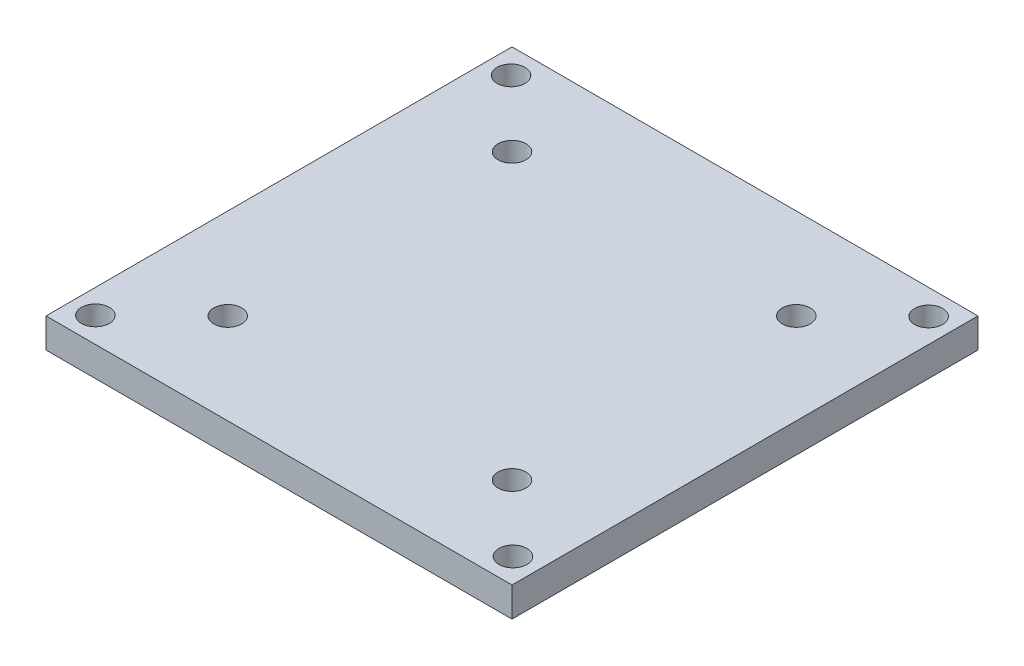
ISO-10303-21;
HEADER;
FILE_DESCRIPTION(('STEP AP214'),'2;1');
FILE_NAME('part.step','',(''),(''),'','','');
FILE_SCHEMA(('AUTOMOTIVE_DESIGN { 1 0 10303 214 1 1 1 1 }'));
ENDSEC;
DATA;
#1=APPLICATION_CONTEXT('core data for automotive mechanical design processes');
#2=APPLICATION_PROTOCOL_DEFINITION('international standard','automotive_design',2000,#1);
#3=PRODUCT_CONTEXT('',#1,'mechanical');
#4=PRODUCT('Part','Part','',(#3));
#5=PRODUCT_RELATED_PRODUCT_CATEGORY('part','',(#4));
#6=PRODUCT_DEFINITION_FORMATION('','',#4);
#7=PRODUCT_DEFINITION_CONTEXT('part definition',#1,'design');
#8=PRODUCT_DEFINITION('design','',#6,#7);
#9=PRODUCT_DEFINITION_SHAPE('','',#8);
#10=(LENGTH_UNIT() NAMED_UNIT(*) SI_UNIT(.MILLI.,.METRE.));
#11=(NAMED_UNIT(*) PLANE_ANGLE_UNIT() SI_UNIT($,.RADIAN.));
#12=(NAMED_UNIT(*) SI_UNIT($,.STERADIAN.) SOLID_ANGLE_UNIT());
#13=UNCERTAINTY_MEASURE_WITH_UNIT(LENGTH_MEASURE(1.E-05),#10,'distance_accuracy_value','');
#14=(GEOMETRIC_REPRESENTATION_CONTEXT(3) GLOBAL_UNCERTAINTY_ASSIGNED_CONTEXT((#13)) GLOBAL_UNIT_ASSIGNED_CONTEXT((#10,
#11,#12)) REPRESENTATION_CONTEXT('',''));
#15=CARTESIAN_POINT('',(0.,0.,0.));
#16=DIRECTION('',(0.,0.,1.));
#17=DIRECTION('',(1.,0.,0.));
#18=AXIS2_PLACEMENT_3D('',#15,#16,#17);
#19=CARTESIAN_POINT('',(0.,3.175,-25.));
#20=DIRECTION('',(0.,0.,1.));
#21=DIRECTION('',(1.,0.,0.));
#22=AXIS2_PLACEMENT_3D('',#19,#20,#21);
#23=PLANE('',#22);
#24=DIRECTION('',(-1.,0.,0.));
#25=VECTOR('',#24,1.);
#26=CARTESIAN_POINT('',(0.,0.,-25.));
#27=LINE('',#26,#25);
#28=CARTESIAN_POINT('',(25.,0.,-25.));
#29=VERTEX_POINT('',#28);
#30=CARTESIAN_POINT('',(-25.,0.,-25.));
#31=VERTEX_POINT('',#30);
#32=EDGE_CURVE('E146',#29,#31,#27,.T.);
#33=ORIENTED_EDGE('',*,*,#32,.T.);
#34=DIRECTION('',(0.,-1.,0.));
#35=VECTOR('',#34,1.);
#36=CARTESIAN_POINT('',(-25.,3.175,-25.));
#37=LINE('',#36,#35);
#38=CARTESIAN_POINT('',(-25.,3.175,-25.));
#39=VERTEX_POINT('',#38);
#40=EDGE_CURVE('E11',#39,#31,#37,.T.);
#41=ORIENTED_EDGE('',*,*,#40,.F.);
#42=DIRECTION('',(-1.,0.,0.));
#43=VECTOR('',#42,1.);
#44=CARTESIAN_POINT('',(0.,3.175,-25.));
#45=LINE('',#44,#43);
#46=CARTESIAN_POINT('',(25.,3.175,-25.));
#47=VERTEX_POINT('',#46);
#48=EDGE_CURVE('E96',#47,#39,#45,.T.);
#49=ORIENTED_EDGE('',*,*,#48,.F.);
#50=DIRECTION('',(0.,-1.,0.));
#51=VECTOR('',#50,1.);
#52=CARTESIAN_POINT('',(25.,3.175,-25.));
#53=LINE('',#52,#51);
#54=EDGE_CURVE('E63',#47,#29,#53,.T.);
#55=ORIENTED_EDGE('',*,*,#54,.T.);
#56=EDGE_LOOP('',(#33,#41,#49,#55));
#57=FACE_BOUND('',#56,.T.);
#58=ADVANCED_FACE('F45',(#57),#23,.F.);
#59=CARTESIAN_POINT('',(-25.,3.175,0.));
#60=DIRECTION('',(1.,0.,0.));
#61=DIRECTION('',(0.,0.,-1.));
#62=AXIS2_PLACEMENT_3D('',#59,#60,#61);
#63=PLANE('',#62);
#64=DIRECTION('',(0.,0.,1.));
#65=VECTOR('',#64,1.);
#66=CARTESIAN_POINT('',(-25.,0.,0.));
#67=LINE('',#66,#65);
#68=CARTESIAN_POINT('',(-25.,0.,25.));
#69=VERTEX_POINT('',#68);
#70=EDGE_CURVE('E102',#31,#69,#67,.T.);
#71=ORIENTED_EDGE('',*,*,#70,.T.);
#72=DIRECTION('',(0.,-1.,0.));
#73=VECTOR('',#72,1.);
#74=CARTESIAN_POINT('',(-25.,3.175,25.));
#75=LINE('',#74,#73);
#76=CARTESIAN_POINT('',(-25.,3.175,25.));
#77=VERTEX_POINT('',#76);
#78=EDGE_CURVE('E55',#77,#69,#75,.T.);
#79=ORIENTED_EDGE('',*,*,#78,.F.);
#80=DIRECTION('',(0.,0.,1.));
#81=VECTOR('',#80,1.);
#82=CARTESIAN_POINT('',(-25.,3.175,0.));
#83=LINE('',#82,#81);
#84=EDGE_CURVE('E88',#39,#77,#83,.T.);
#85=ORIENTED_EDGE('',*,*,#84,.F.);
#86=ORIENTED_EDGE('',*,*,#40,.T.);
#87=EDGE_LOOP('',(#71,#79,#85,#86));
#88=FACE_BOUND('',#87,.T.);
#89=ADVANCED_FACE('F101',(#88),#63,.F.);
#90=CARTESIAN_POINT('',(0.,3.175,25.));
#91=DIRECTION('',(0.,0.,1.));
#92=DIRECTION('',(1.,0.,0.));
#93=AXIS2_PLACEMENT_3D('',#90,#91,#92);
#94=PLANE('',#93);
#95=DIRECTION('',(-1.,0.,0.));
#96=VECTOR('',#95,1.);
#97=CARTESIAN_POINT('',(0.,0.,25.));
#98=LINE('',#97,#96);
#99=CARTESIAN_POINT('',(25.,0.,25.));
#100=VERTEX_POINT('',#99);
#101=EDGE_CURVE('E151',#100,#69,#98,.T.);
#102=ORIENTED_EDGE('',*,*,#101,.F.);
#103=DIRECTION('',(0.,-1.,0.));
#104=VECTOR('',#103,1.);
#105=CARTESIAN_POINT('',(25.,3.175,25.));
#106=LINE('',#105,#104);
#107=CARTESIAN_POINT('',(25.,3.175,25.));
#108=VERTEX_POINT('',#107);
#109=EDGE_CURVE('E77',#108,#100,#106,.T.);
#110=ORIENTED_EDGE('',*,*,#109,.F.);
#111=DIRECTION('',(-1.,0.,0.));
#112=VECTOR('',#111,1.);
#113=CARTESIAN_POINT('',(0.,3.175,25.));
#114=LINE('',#113,#112);
#115=EDGE_CURVE('E95',#108,#77,#114,.T.);
#116=ORIENTED_EDGE('',*,*,#115,.T.);
#117=ORIENTED_EDGE('',*,*,#78,.T.);
#118=EDGE_LOOP('',(#102,#110,#116,#117));
#119=FACE_BOUND('',#118,.T.);
#120=ADVANCED_FACE('F106',(#119),#94,.T.);
#121=CARTESIAN_POINT('',(-22.4,3.175,-22.3));
#122=DIRECTION('',(0.,-1.,0.));
#123=DIRECTION('',(0.,0.,-1.));
#124=AXIS2_PLACEMENT_3D('',#121,#122,#123);
#125=CYLINDRICAL_SURFACE('',#124,1.5);
#126=CARTESIAN_POINT('',(-22.4,3.175,-22.3));
#127=DIRECTION('',(0.,1.,0.));
#128=DIRECTION('',(0.,0.,1.));
#129=AXIS2_PLACEMENT_3D('',#126,#127,#128);
#130=CIRCLE('',#129,1.5);
#131=CARTESIAN_POINT('',(-22.4,3.175,-20.8));
#132=VERTEX_POINT('',#131);
#133=EDGE_CURVE('E193',#132,#132,#130,.T.);
#134=ORIENTED_EDGE('',*,*,#133,.T.);
#135=EDGE_LOOP('',(#134));
#136=FACE_BOUND('',#135,.T.);
#137=CARTESIAN_POINT('',(-22.4,0.,-22.3));
#138=DIRECTION('',(0.,1.,0.));
#139=DIRECTION('',(0.,0.,1.));
#140=AXIS2_PLACEMENT_3D('',#137,#138,#139);
#141=CIRCLE('',#140,1.5);
#142=CARTESIAN_POINT('',(-22.4,0.,-20.8));
#143=VERTEX_POINT('',#142);
#144=EDGE_CURVE('E142',#143,#143,#141,.T.);
#145=ORIENTED_EDGE('',*,*,#144,.F.);
#146=EDGE_LOOP('',(#145));
#147=FACE_BOUND('',#146,.T.);
#148=ADVANCED_FACE('F199',(#136,#147),#125,.F.);
#149=CARTESIAN_POINT('',(22.4,3.175,-22.3));
#150=DIRECTION('',(0.,-1.,0.));
#151=DIRECTION('',(0.,0.,-1.));
#152=AXIS2_PLACEMENT_3D('',#149,#150,#151);
#153=CYLINDRICAL_SURFACE('',#152,1.5);
#154=CARTESIAN_POINT('',(22.4,3.175,-22.3));
#155=DIRECTION('',(0.,1.,0.));
#156=DIRECTION('',(0.,0.,1.));
#157=AXIS2_PLACEMENT_3D('',#154,#155,#156);
#158=CIRCLE('',#157,1.5);
#159=CARTESIAN_POINT('',(22.4,3.175,-20.8));
#160=VERTEX_POINT('',#159);
#161=EDGE_CURVE('E189',#160,#160,#158,.T.);
#162=ORIENTED_EDGE('',*,*,#161,.T.);
#163=EDGE_LOOP('',(#162));
#164=FACE_BOUND('',#163,.T.);
#165=CARTESIAN_POINT('',(22.4,0.,-22.3));
#166=DIRECTION('',(0.,1.,0.));
#167=DIRECTION('',(0.,0.,1.));
#168=AXIS2_PLACEMENT_3D('',#165,#166,#167);
#169=CIRCLE('',#168,1.5);
#170=CARTESIAN_POINT('',(22.4,0.,-20.8));
#171=VERTEX_POINT('',#170);
#172=EDGE_CURVE('E138',#171,#171,#169,.T.);
#173=ORIENTED_EDGE('',*,*,#172,.F.);
#174=EDGE_LOOP('',(#173));
#175=FACE_BOUND('',#174,.T.);
#176=ADVANCED_FACE('F225',(#164,#175),#153,.F.);
#177=CARTESIAN_POINT('',(22.4000000000005,3.175,22.3));
#178=DIRECTION('',(0.,-1.,0.));
#179=DIRECTION('',(0.,0.,-1.));
#180=AXIS2_PLACEMENT_3D('',#177,#178,#179);
#181=CYLINDRICAL_SURFACE('',#180,1.5);
#182=CARTESIAN_POINT('',(22.4000000000005,3.175,22.3));
#183=DIRECTION('',(0.,1.,0.));
#184=DIRECTION('',(0.,0.,1.));
#185=AXIS2_PLACEMENT_3D('',#182,#183,#184);
#186=CIRCLE('',#185,1.5);
#187=CARTESIAN_POINT('',(22.4000000000005,3.175,23.8));
#188=VERTEX_POINT('',#187);
#189=EDGE_CURVE('E185',#188,#188,#186,.T.);
#190=ORIENTED_EDGE('',*,*,#189,.T.);
#191=EDGE_LOOP('',(#190));
#192=FACE_BOUND('',#191,.T.);
#193=CARTESIAN_POINT('',(22.4000000000005,0.,22.3));
#194=DIRECTION('',(0.,1.,0.));
#195=DIRECTION('',(0.,0.,1.));
#196=AXIS2_PLACEMENT_3D('',#193,#194,#195);
#197=CIRCLE('',#196,1.5);
#198=CARTESIAN_POINT('',(22.4000000000005,0.,23.8));
#199=VERTEX_POINT('',#198);
#200=EDGE_CURVE('E134',#199,#199,#197,.T.);
#201=ORIENTED_EDGE('',*,*,#200,.F.);
#202=EDGE_LOOP('',(#201));
#203=FACE_BOUND('',#202,.T.);
#204=ADVANCED_FACE('F228',(#192,#203),#181,.F.);
#205=CARTESIAN_POINT('',(-22.3999999999995,3.175,22.3));
#206=DIRECTION('',(0.,-1.,0.));
#207=DIRECTION('',(0.,0.,-1.));
#208=AXIS2_PLACEMENT_3D('',#205,#206,#207);
#209=CYLINDRICAL_SURFACE('',#208,1.5);
#210=CARTESIAN_POINT('',(-22.3999999999995,3.175,22.3));
#211=DIRECTION('',(0.,1.,0.));
#212=DIRECTION('',(0.,0.,1.));
#213=AXIS2_PLACEMENT_3D('',#210,#211,#212);
#214=CIRCLE('',#213,1.5);
#215=CARTESIAN_POINT('',(-22.3999999999995,3.175,23.8));
#216=VERTEX_POINT('',#215);
#217=EDGE_CURVE('E181',#216,#216,#214,.T.);
#218=ORIENTED_EDGE('',*,*,#217,.T.);
#219=EDGE_LOOP('',(#218));
#220=FACE_BOUND('',#219,.T.);
#221=CARTESIAN_POINT('',(-22.3999999999995,0.,22.3));
#222=DIRECTION('',(0.,1.,0.));
#223=DIRECTION('',(0.,0.,1.));
#224=AXIS2_PLACEMENT_3D('',#221,#222,#223);
#225=CIRCLE('',#224,1.5);
#226=CARTESIAN_POINT('',(-22.3999999999995,0.,23.8));
#227=VERTEX_POINT('',#226);
#228=EDGE_CURVE('E130',#227,#227,#225,.T.);
#229=ORIENTED_EDGE('',*,*,#228,.F.);
#230=EDGE_LOOP('',(#229));
#231=FACE_BOUND('',#230,.T.);
#232=ADVANCED_FACE('F232',(#220,#231),#209,.F.);
#233=CARTESIAN_POINT('',(-15.25,3.175,-15.25));
#234=DIRECTION('',(0.,-1.,0.));
#235=DIRECTION('',(0.,0.,-1.));
#236=AXIS2_PLACEMENT_3D('',#233,#234,#235);
#237=CYLINDRICAL_SURFACE('',#236,1.5);
#238=CARTESIAN_POINT('',(-15.25,3.175,-15.25));
#239=DIRECTION('',(0.,1.,0.));
#240=DIRECTION('',(0.,0.,1.));
#241=AXIS2_PLACEMENT_3D('',#238,#239,#240);
#242=CIRCLE('',#241,1.5);
#243=CARTESIAN_POINT('',(-15.25,3.175,-13.75));
#244=VERTEX_POINT('',#243);
#245=EDGE_CURVE('E177',#244,#244,#242,.T.);
#246=ORIENTED_EDGE('',*,*,#245,.T.);
#247=EDGE_LOOP('',(#246));
#248=FACE_BOUND('',#247,.T.);
#249=CARTESIAN_POINT('',(-15.25,0.,-15.25));
#250=DIRECTION('',(0.,1.,0.));
#251=DIRECTION('',(0.,0.,1.));
#252=AXIS2_PLACEMENT_3D('',#249,#250,#251);
#253=CIRCLE('',#252,1.5);
#254=CARTESIAN_POINT('',(-15.25,0.,-13.75));
#255=VERTEX_POINT('',#254);
#256=EDGE_CURVE('E126',#255,#255,#253,.T.);
#257=ORIENTED_EDGE('',*,*,#256,.F.);
#258=EDGE_LOOP('',(#257));
#259=FACE_BOUND('',#258,.T.);
#260=ADVANCED_FACE('F236',(#248,#259),#237,.F.);
#261=CARTESIAN_POINT('',(15.25,3.175,-15.25));
#262=DIRECTION('',(0.,-1.,0.));
#263=DIRECTION('',(0.,0.,-1.));
#264=AXIS2_PLACEMENT_3D('',#261,#262,#263);
#265=CYLINDRICAL_SURFACE('',#264,1.5);
#266=CARTESIAN_POINT('',(15.25,3.175,-15.25));
#267=DIRECTION('',(0.,1.,0.));
#268=DIRECTION('',(0.,0.,1.));
#269=AXIS2_PLACEMENT_3D('',#266,#267,#268);
#270=CIRCLE('',#269,1.5);
#271=CARTESIAN_POINT('',(15.25,3.175,-13.75));
#272=VERTEX_POINT('',#271);
#273=EDGE_CURVE('E171',#272,#272,#270,.T.);
#274=ORIENTED_EDGE('',*,*,#273,.T.);
#275=EDGE_LOOP('',(#274));
#276=FACE_BOUND('',#275,.T.);
#277=CARTESIAN_POINT('',(15.25,0.,-15.25));
#278=DIRECTION('',(0.,1.,0.));
#279=DIRECTION('',(0.,0.,1.));
#280=AXIS2_PLACEMENT_3D('',#277,#278,#279);
#281=CIRCLE('',#280,1.5);
#282=CARTESIAN_POINT('',(15.25,0.,-13.75));
#283=VERTEX_POINT('',#282);
#284=EDGE_CURVE('E122',#283,#283,#281,.T.);
#285=ORIENTED_EDGE('',*,*,#284,.F.);
#286=EDGE_LOOP('',(#285));
#287=FACE_BOUND('',#286,.T.);
#288=ADVANCED_FACE('F240',(#276,#287),#265,.F.);
#289=CARTESIAN_POINT('',(15.2500000000003,3.175,15.25));
#290=DIRECTION('',(0.,-1.,0.));
#291=DIRECTION('',(0.,0.,-1.));
#292=AXIS2_PLACEMENT_3D('',#289,#290,#291);
#293=CYLINDRICAL_SURFACE('',#292,1.5);
#294=CARTESIAN_POINT('',(15.2500000000003,3.175,15.25));
#295=DIRECTION('',(0.,1.,0.));
#296=DIRECTION('',(0.,0.,1.));
#297=AXIS2_PLACEMENT_3D('',#294,#295,#296);
#298=CIRCLE('',#297,1.5);
#299=CARTESIAN_POINT('',(15.2500000000003,3.175,16.75));
#300=VERTEX_POINT('',#299);
#301=EDGE_CURVE('E165',#300,#300,#298,.T.);
#302=ORIENTED_EDGE('',*,*,#301,.T.);
#303=EDGE_LOOP('',(#302));
#304=FACE_BOUND('',#303,.T.);
#305=CARTESIAN_POINT('',(15.2500000000003,0.,15.25));
#306=DIRECTION('',(0.,1.,0.));
#307=DIRECTION('',(0.,0.,1.));
#308=AXIS2_PLACEMENT_3D('',#305,#306,#307);
#309=CIRCLE('',#308,1.5);
#310=CARTESIAN_POINT('',(15.2500000000003,0.,16.75));
#311=VERTEX_POINT('',#310);
#312=EDGE_CURVE('E118',#311,#311,#309,.T.);
#313=ORIENTED_EDGE('',*,*,#312,.F.);
#314=EDGE_LOOP('',(#313));
#315=FACE_BOUND('',#314,.T.);
#316=ADVANCED_FACE('F243',(#304,#315),#293,.F.);
#317=CARTESIAN_POINT('',(-15.2499999999997,3.175,15.25));
#318=DIRECTION('',(0.,-1.,0.));
#319=DIRECTION('',(0.,0.,-1.));
#320=AXIS2_PLACEMENT_3D('',#317,#318,#319);
#321=CYLINDRICAL_SURFACE('',#320,1.5);
#322=CARTESIAN_POINT('',(-15.2499999999997,3.175,15.25));
#323=DIRECTION('',(0.,1.,0.));
#324=DIRECTION('',(0.,0.,1.));
#325=AXIS2_PLACEMENT_3D('',#322,#323,#324);
#326=CIRCLE('',#325,1.5);
#327=CARTESIAN_POINT('',(-15.2499999999997,3.175,16.75));
#328=VERTEX_POINT('',#327);
#329=EDGE_CURVE('E158',#328,#328,#326,.T.);
#330=ORIENTED_EDGE('',*,*,#329,.T.);
#331=EDGE_LOOP('',(#330));
#332=FACE_BOUND('',#331,.T.);
#333=CARTESIAN_POINT('',(-15.2499999999997,0.,15.25));
#334=DIRECTION('',(0.,1.,0.));
#335=DIRECTION('',(0.,0.,1.));
#336=AXIS2_PLACEMENT_3D('',#333,#334,#335);
#337=CIRCLE('',#336,1.5);
#338=CARTESIAN_POINT('',(-15.2499999999997,0.,16.75));
#339=VERTEX_POINT('',#338);
#340=EDGE_CURVE('E114',#339,#339,#337,.T.);
#341=ORIENTED_EDGE('',*,*,#340,.F.);
#342=EDGE_LOOP('',(#341));
#343=FACE_BOUND('',#342,.T.);
#344=ADVANCED_FACE('F47',(#332,#343),#321,.F.);
#345=CARTESIAN_POINT('',(25.,3.175,0.));
#346=DIRECTION('',(1.,0.,0.));
#347=DIRECTION('',(0.,0.,-1.));
#348=AXIS2_PLACEMENT_3D('',#345,#346,#347);
#349=PLANE('',#348);
#350=DIRECTION('',(0.,0.,1.));
#351=VECTOR('',#350,1.);
#352=CARTESIAN_POINT('',(25.,0.,0.));
#353=LINE('',#352,#351);
#354=EDGE_CURVE('E154',#29,#100,#353,.T.);
#355=ORIENTED_EDGE('',*,*,#354,.F.);
#356=ORIENTED_EDGE('',*,*,#54,.F.);
#357=DIRECTION('',(0.,0.,1.));
#358=VECTOR('',#357,1.);
#359=CARTESIAN_POINT('',(25.,3.175,0.));
#360=LINE('',#359,#358);
#361=EDGE_CURVE('E108',#47,#108,#360,.T.);
#362=ORIENTED_EDGE('',*,*,#361,.T.);
#363=ORIENTED_EDGE('',*,*,#109,.T.);
#364=EDGE_LOOP('',(#355,#356,#362,#363));
#365=FACE_BOUND('',#364,.T.);
#366=ADVANCED_FACE('F204',(#365),#349,.T.);
#367=CARTESIAN_POINT('',(0.,3.175,0.));
#368=DIRECTION('',(0.,1.,0.));
#369=DIRECTION('',(0.,0.,1.));
#370=AXIS2_PLACEMENT_3D('',#367,#368,#369);
#371=PLANE('',#370);
#372=ORIENTED_EDGE('',*,*,#329,.F.);
#373=EDGE_LOOP('',(#372));
#374=FACE_BOUND('',#373,.T.);
#375=ORIENTED_EDGE('',*,*,#301,.F.);
#376=EDGE_LOOP('',(#375));
#377=FACE_BOUND('',#376,.T.);
#378=ORIENTED_EDGE('',*,*,#273,.F.);
#379=EDGE_LOOP('',(#378));
#380=FACE_BOUND('',#379,.T.);
#381=ORIENTED_EDGE('',*,*,#245,.F.);
#382=EDGE_LOOP('',(#381));
#383=FACE_BOUND('',#382,.T.);
#384=ORIENTED_EDGE('',*,*,#217,.F.);
#385=EDGE_LOOP('',(#384));
#386=FACE_BOUND('',#385,.T.);
#387=ORIENTED_EDGE('',*,*,#189,.F.);
#388=EDGE_LOOP('',(#387));
#389=FACE_BOUND('',#388,.T.);
#390=ORIENTED_EDGE('',*,*,#161,.F.);
#391=EDGE_LOOP('',(#390));
#392=FACE_BOUND('',#391,.T.);
#393=ORIENTED_EDGE('',*,*,#133,.F.);
#394=EDGE_LOOP('',(#393));
#395=FACE_BOUND('',#394,.T.);
#396=ORIENTED_EDGE('',*,*,#48,.T.);
#397=ORIENTED_EDGE('',*,*,#84,.T.);
#398=ORIENTED_EDGE('',*,*,#115,.F.);
#399=ORIENTED_EDGE('',*,*,#361,.F.);
#400=EDGE_LOOP('',(#396,#397,#398,#399));
#401=FACE_BOUND('',#400,.T.);
#402=ADVANCED_FACE('F92',(#374,#377,#380,#383,#386,#389,#392,#395,#401),#371,.T.);
#403=CARTESIAN_POINT('',(0.,0.,0.));
#404=DIRECTION('',(0.,1.,0.));
#405=DIRECTION('',(0.,0.,1.));
#406=AXIS2_PLACEMENT_3D('',#403,#404,#405);
#407=PLANE('',#406);
#408=ORIENTED_EDGE('',*,*,#340,.T.);
#409=EDGE_LOOP('',(#408));
#410=FACE_BOUND('',#409,.T.);
#411=ORIENTED_EDGE('',*,*,#312,.T.);
#412=EDGE_LOOP('',(#411));
#413=FACE_BOUND('',#412,.T.);
#414=ORIENTED_EDGE('',*,*,#284,.T.);
#415=EDGE_LOOP('',(#414));
#416=FACE_BOUND('',#415,.T.);
#417=ORIENTED_EDGE('',*,*,#256,.T.);
#418=EDGE_LOOP('',(#417));
#419=FACE_BOUND('',#418,.T.);
#420=ORIENTED_EDGE('',*,*,#228,.T.);
#421=EDGE_LOOP('',(#420));
#422=FACE_BOUND('',#421,.T.);
#423=ORIENTED_EDGE('',*,*,#200,.T.);
#424=EDGE_LOOP('',(#423));
#425=FACE_BOUND('',#424,.T.);
#426=ORIENTED_EDGE('',*,*,#172,.T.);
#427=EDGE_LOOP('',(#426));
#428=FACE_BOUND('',#427,.T.);
#429=ORIENTED_EDGE('',*,*,#144,.T.);
#430=EDGE_LOOP('',(#429));
#431=FACE_BOUND('',#430,.T.);
#432=ORIENTED_EDGE('',*,*,#32,.F.);
#433=ORIENTED_EDGE('',*,*,#354,.T.);
#434=ORIENTED_EDGE('',*,*,#101,.T.);
#435=ORIENTED_EDGE('',*,*,#70,.F.);
#436=EDGE_LOOP('',(#432,#433,#434,#435));
#437=FACE_BOUND('',#436,.T.);
#438=ADVANCED_FACE('F203',(#410,#413,#416,#419,#422,#425,#428,#431,#437),#407,.F.);
#439=CLOSED_SHELL('',(#58,#89,#120,#148,#176,#204,#232,#260,#288,#316,#344,#366,#402,#438));
#440=MANIFOLD_SOLID_BREP('B2',#439);
#441=ADVANCED_BREP_SHAPE_REPRESENTATION('',(#18,#440),#14);
#442=SHAPE_DEFINITION_REPRESENTATION(#9,#441);
ENDSEC;
END-ISO-10303-21;
